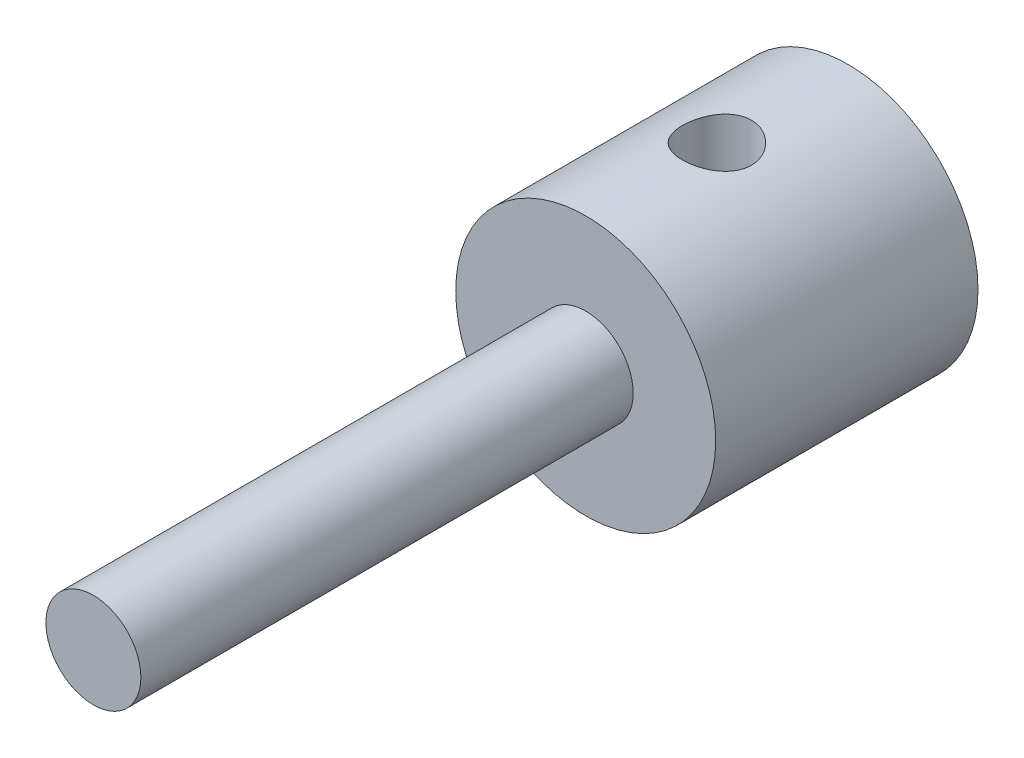
ISO-10303-21;
HEADER;
FILE_DESCRIPTION(('STEP AP214'),'2;1');
FILE_NAME('part.step','',(''),(''),'','','');
FILE_SCHEMA(('AUTOMOTIVE_DESIGN { 1 0 10303 214 1 1 1 1 }'));
ENDSEC;
DATA;
#1=APPLICATION_CONTEXT('core data for automotive mechanical design processes');
#2=APPLICATION_PROTOCOL_DEFINITION('international standard','automotive_design',2000,#1);
#3=PRODUCT_CONTEXT('',#1,'mechanical');
#4=PRODUCT('Part','Part','',(#3));
#5=PRODUCT_RELATED_PRODUCT_CATEGORY('part','',(#4));
#6=PRODUCT_DEFINITION_FORMATION('','',#4);
#7=PRODUCT_DEFINITION_CONTEXT('part definition',#1,'design');
#8=PRODUCT_DEFINITION('design','',#6,#7);
#9=PRODUCT_DEFINITION_SHAPE('','',#8);
#10=(LENGTH_UNIT() NAMED_UNIT(*) SI_UNIT(.MILLI.,.METRE.));
#11=(NAMED_UNIT(*) PLANE_ANGLE_UNIT() SI_UNIT($,.RADIAN.));
#12=(NAMED_UNIT(*) SI_UNIT($,.STERADIAN.) SOLID_ANGLE_UNIT());
#13=UNCERTAINTY_MEASURE_WITH_UNIT(LENGTH_MEASURE(1.E-05),#10,'distance_accuracy_value','');
#14=(GEOMETRIC_REPRESENTATION_CONTEXT(3) GLOBAL_UNCERTAINTY_ASSIGNED_CONTEXT((#13)) GLOBAL_UNIT_ASSIGNED_CONTEXT((#10,
#11,#12)) REPRESENTATION_CONTEXT('',''));
#15=CARTESIAN_POINT('',(0.,0.,0.));
#16=DIRECTION('',(0.,0.,1.));
#17=DIRECTION('',(1.,0.,0.));
#18=AXIS2_PLACEMENT_3D('',#15,#16,#17);
#19=CARTESIAN_POINT('',(0.,0.,-16.9164));
#20=DIRECTION('',(0.,0.,1.));
#21=DIRECTION('',(1.,0.,0.));
#22=AXIS2_PLACEMENT_3D('',#19,#20,#21);
#23=CYLINDRICAL_SURFACE('',#22,8.382);
#24=CARTESIAN_POINT('',(0.,0.,-16.9164));
#25=DIRECTION('',(0.,0.,-1.));
#26=DIRECTION('',(-1.,0.,0.));
#27=AXIS2_PLACEMENT_3D('',#24,#25,#26);
#28=CIRCLE('',#27,8.382);
#29=CARTESIAN_POINT('',(-8.382,0.,-16.9164));
#30=VERTEX_POINT('',#29);
#31=EDGE_CURVE('E50',#30,#30,#28,.T.);
#32=ORIENTED_EDGE('',*,*,#31,.F.);
#33=EDGE_LOOP('',(#32));
#34=FACE_BOUND('',#33,.T.);
#35=CARTESIAN_POINT('',(0.,0.,0.));
#36=DIRECTION('',(0.,0.,-1.));
#37=DIRECTION('',(-1.,0.,0.));
#38=AXIS2_PLACEMENT_3D('',#35,#36,#37);
#39=CIRCLE('',#38,8.382);
#40=CARTESIAN_POINT('',(-8.382,0.,0.));
#41=VERTEX_POINT('',#40);
#42=EDGE_CURVE('E52',#41,#41,#39,.T.);
#43=ORIENTED_EDGE('',*,*,#42,.T.);
#44=EDGE_LOOP('',(#43));
#45=FACE_BOUND('',#44,.T.);
#46=CARTESIAN_POINT('',(0.,8.382,-10.6807));
#47=CARTESIAN_POINT('',(-0.122545978010974,8.38199812819265,-10.6806970386751));
#48=CARTESIAN_POINT('',(-0.245123812219142,8.37928606400811,-10.670530452493));
#49=CARTESIAN_POINT('',(-0.486750048253878,8.36873043580727,-10.6302036663211));
#50=CARTESIAN_POINT('',(-0.605796693728954,8.36088436152248,-10.600033685598));
#51=CARTESIAN_POINT('',(-0.836837709561361,8.340926976709,-10.5207486710754));
#52=CARTESIAN_POINT('',(-0.948840901826804,8.32882113221359,-10.4716579083018));
#53=CARTESIAN_POINT('',(-1.16302416092692,8.30162450100949,-10.3560143856605));
#54=CARTESIAN_POINT('',(-1.26520360216536,8.28653352438844,-10.2894605147121));
#55=CARTESIAN_POINT('',(-1.45918344615048,8.25460959558927,-10.1391676179766));
#56=CARTESIAN_POINT('',(-1.55072631789723,8.23774713494352,-10.0551024625791));
#57=CARTESIAN_POINT('',(-1.71859362699717,8.20437082792396,-9.87287056469384));
#58=CARTESIAN_POINT('',(-1.79491612859954,8.18785702613164,-9.77470203124415));
#59=CARTESIAN_POINT('',(-1.93142771187019,8.1567463498054,-9.56499961077496));
#60=CARTESIAN_POINT('',(-1.99132128812834,8.1421867270313,-9.4532673227285));
#61=CARTESIAN_POINT('',(-2.09137178766778,8.11706643134214,-9.22087049946759));
#62=CARTESIAN_POINT('',(-2.13153230442965,8.10650503041303,-9.10020759516771));
#63=CARTESIAN_POINT('',(-2.19008375489065,8.09088150859754,-8.85622495756124));
#64=CARTESIAN_POINT('',(-2.20894124866035,8.08570173659757,-8.73302490682429));
#65=CARTESIAN_POINT('',(-2.22580580408932,8.08107637704488,-8.485109380742));
#66=CARTESIAN_POINT('',(-2.2238167139541,8.08162973117719,-8.36039418933174));
#67=CARTESIAN_POINT('',(-2.19941513873925,8.08830275877684,-8.11662404790133));
#68=CARTESIAN_POINT('',(-2.17756640119818,8.09426877646218,-7.99750779224802));
#69=CARTESIAN_POINT('',(-2.11496831355642,8.11084898776264,-7.76469520412358));
#70=CARTESIAN_POINT('',(-2.07421746813168,8.12146354911501,-7.6509993012352));
#71=CARTESIAN_POINT('',(-1.97451059869689,8.14628051850551,-7.43078141847667));
#72=CARTESIAN_POINT('',(-1.91535629063855,8.16052168164815,-7.32435376638653));
#73=CARTESIAN_POINT('',(-1.78066003182863,8.19096630395646,-7.12273694833066));
#74=CARTESIAN_POINT('',(-1.70511488828672,8.20717014516251,-7.02754997753708));
#75=CARTESIAN_POINT('',(-1.53689541110288,8.2403546405082,-6.84789470298942));
#76=CARTESIAN_POINT('',(-1.44374745386335,8.25734349869242,-6.76387077258234));
#77=CARTESIAN_POINT('',(-1.24447573385291,8.28971521559526,-6.61254602222629));
#78=CARTESIAN_POINT('',(-1.13835147133515,8.30509801241851,-6.54524584664979));
#79=CARTESIAN_POINT('',(-0.915456516708525,8.33261724039363,-6.42908642260741));
#80=CARTESIAN_POINT('',(-0.798642465139369,8.34473958658721,-6.38030682028556));
#81=CARTESIAN_POINT('',(-0.558077200635521,8.36427019139612,-6.30320566029928));
#82=CARTESIAN_POINT('',(-0.434327492072818,8.37167946802241,-6.27487968452517));
#83=CARTESIAN_POINT('',(-0.187196728785683,8.38079546465543,-6.24018579052901));
#84=CARTESIAN_POINT('',(-0.0639061623063624,8.38265906728263,-6.23321361931867));
#85=CARTESIAN_POINT('',(0.182082370726127,8.38092439164999,-6.23975759376545));
#86=CARTESIAN_POINT('',(0.304780396500954,8.3773266710522,-6.25327164755014));
#87=CARTESIAN_POINT('',(0.543949548413527,8.36517485010715,-6.29990859604152));
#88=CARTESIAN_POINT('',(0.660490978349239,8.3567058168777,-6.33269514799398));
#89=CARTESIAN_POINT('',(0.886408813652359,8.33577144200168,-6.41655642238661));
#90=CARTESIAN_POINT('',(0.995784445627639,8.32330566984695,-6.46763311501602));
#91=CARTESIAN_POINT('',(1.20661906617733,8.29539221507168,-6.58775027516686));
#92=CARTESIAN_POINT('',(1.30788303722989,8.27989131954893,-6.65712037148793));
#93=CARTESIAN_POINT('',(1.49754524093512,8.24769979907366,-6.81144013424169));
#94=CARTESIAN_POINT('',(1.58594095610842,8.23100894227215,-6.8963928418492));
#95=CARTESIAN_POINT('',(1.74989844085297,8.19774260926374,-7.08228492711395));
#96=CARTESIAN_POINT('',(1.82503409966079,8.18118329948936,-7.18360372067792));
#97=CARTESIAN_POINT('',(1.95724501291735,8.15056678188702,-7.39776100874965));
#98=CARTESIAN_POINT('',(2.01432102734526,8.13650946878185,-7.5105990182457));
#99=CARTESIAN_POINT('',(2.10836282435713,8.11264970195112,-7.74402378231656));
#100=CARTESIAN_POINT('',(2.14544544614609,8.10282259693757,-7.86456080933321));
#101=CARTESIAN_POINT('',(2.19872740220765,8.08852874432499,-8.11046399025629));
#102=CARTESIAN_POINT('',(2.21493199965927,8.08406064578392,-8.23582891887784));
#103=CARTESIAN_POINT('',(2.22569771544055,8.08110263926647,-8.48346924969944));
#104=CARTESIAN_POINT('',(2.22094333883804,8.0824236545137,-8.60571308410831));
#105=CARTESIAN_POINT('',(2.19151189817098,8.09045286267922,-8.84758893810199));
#106=CARTESIAN_POINT('',(2.16683533580764,8.0971609199354,-8.96722102338066));
#107=CARTESIAN_POINT('',(2.09865475813775,8.11509649678917,-9.19962690587846));
#108=CARTESIAN_POINT('',(2.05529423391998,8.12628952718532,-9.31244564731772));
#109=CARTESIAN_POINT('',(1.95108818138528,8.151935067394,-9.52929197088521));
#110=CARTESIAN_POINT('',(1.89023993891797,8.1663880830918,-9.63331818513908));
#111=CARTESIAN_POINT('',(1.75070449649565,8.19745080029808,-9.83289765218511));
#112=CARTESIAN_POINT('',(1.67154945137657,8.21411104617803,-9.92811598875334));
#113=CARTESIAN_POINT('',(1.49853913814835,8.24742698426666,-10.1041407692012));
#114=CARTESIAN_POINT('',(1.40468030927723,8.26408267439081,-10.1849437119931));
#115=CARTESIAN_POINT('',(1.20253956910181,8.29593255767638,-10.3315168733423));
#116=CARTESIAN_POINT('',(1.09399535791813,8.31108854765888,-10.3969343505541));
#117=CARTESIAN_POINT('',(0.867052612027074,8.3378149273992,-10.5084900770143));
#118=CARTESIAN_POINT('',(0.748660530095853,8.34938764196668,-10.5546408332058));
#119=CARTESIAN_POINT('',(0.525571813961633,8.36612687817697,-10.6202555406276));
#120=CARTESIAN_POINT('',(0.421846541743947,8.37203615634299,-10.6428699116922));
#121=CARTESIAN_POINT('',(0.212088650749228,8.37997334020725,-10.6730926997705));
#122=CARTESIAN_POINT('',(0.106056255318162,8.38200161993793,-10.6807025628506));
#123=CARTESIAN_POINT('',(0.,8.382,-10.6807));
#124=B_SPLINE_CURVE_WITH_KNOTS('',3,(#46,#47,#48,#49,#50,#51,#52,#53,#54,#55,#56,#57,#58,#59,
#60,#61,#62,#63,#64,#65,#66,#67,#68,#69,#70,#71,#72,#73,#74,#75,#76,#77,#78,#79,#80,#81,#82,#83,
#84,#85,#86,#87,#88,#89,#90,#91,#92,#93,#94,#95,#96,#97,#98,#99,#100,#101,#102,#103,#104,#105,
#106,#107,#108,#109,#110,#111,#112,#113,#114,#115,#116,#117,#118,#119,#120,#121,#122,#123),
.UNSPECIFIED.,.T.,.F.,(4,2,2,2,2,2,2,2,2,2,2,2,2,2,2,2,2,2,2,2,2,2,2,2,2,2,2,2,2,2,2,2,2,2,2,2,
2,2,4),(0.,0.367249024550624,0.734677749414668,1.10163670774985,1.46861901931274,
1.84317026950239,2.21776912537664,2.59871975887543,2.97960099378303,3.35196817977556,
3.72426662931593,4.08631599369094,4.44839400426113,4.81451677461364,5.18071092658654,
5.55870823441772,5.93672010436764,6.31633964995009,6.69587717081559,7.06457070353036,
7.43322659105252,7.79563210274222,8.15807666401272,8.52756069639389,8.89711691586868,
9.27696784974287,9.65680279674585,10.034393284835,10.4118885668166,10.777148102092,
11.1423984393086,11.5048923312803,11.8674425138857,12.2405494597047,12.6137468995502,
12.9948102364691,13.3756258209951,13.6934886445958,14.0113208325245),.UNSPECIFIED.);
#125=CARTESIAN_POINT('',(0.,8.382,-10.6807));
#126=VERTEX_POINT('',#125);
#127=EDGE_CURVE('E61',#126,#126,#124,.T.);
#128=ORIENTED_EDGE('',*,*,#127,.F.);
#129=EDGE_LOOP('',(#128));
#130=FACE_BOUND('',#129,.T.);
#131=ADVANCED_FACE('F33',(#34,#45,#130),#23,.T.);
#132=CARTESIAN_POINT('',(0.,0.,-2.9464));
#133=DIRECTION('',(0.,0.,-1.));
#134=DIRECTION('',(-1.,0.,0.));
#135=AXIS2_PLACEMENT_3D('',#132,#133,#134);
#136=CYLINDRICAL_SURFACE('',#135,2.9972);
#137=CARTESIAN_POINT('',(0.,0.,-2.9464));
#138=DIRECTION('',(0.,0.,-1.));
#139=DIRECTION('',(-1.,0.,0.));
#140=AXIS2_PLACEMENT_3D('',#137,#138,#139);
#141=CIRCLE('',#140,2.9972);
#142=CARTESIAN_POINT('',(-2.9972,0.,-2.9464));
#143=VERTEX_POINT('',#142);
#144=EDGE_CURVE('E55',#143,#143,#141,.T.);
#145=ORIENTED_EDGE('',*,*,#144,.F.);
#146=EDGE_LOOP('',(#145));
#147=FACE_BOUND('',#146,.T.);
#148=CARTESIAN_POINT('',(0.,0.,-16.9164));
#149=DIRECTION('',(0.,0.,-1.));
#150=DIRECTION('',(-1.,0.,0.));
#151=AXIS2_PLACEMENT_3D('',#148,#149,#150);
#152=CIRCLE('',#151,2.9972);
#153=CARTESIAN_POINT('',(-2.9972,0.,-16.9164));
#154=VERTEX_POINT('',#153);
#155=EDGE_CURVE('E58',#154,#154,#152,.T.);
#156=ORIENTED_EDGE('',*,*,#155,.T.);
#157=EDGE_LOOP('',(#156));
#158=FACE_BOUND('',#157,.T.);
#159=CARTESIAN_POINT('',(0.,2.9972,-10.6807));
#160=CARTESIAN_POINT('',(0.109035099131948,2.99720532292805,-10.6807056711309));
#161=CARTESIAN_POINT('',(0.218041881013003,2.99120315374028,-10.6726320712692));
#162=CARTESIAN_POINT('',(0.432500741748234,2.96779220280792,-10.6409055543326));
#163=CARTESIAN_POINT('',(0.537951674348827,2.95037977915565,-10.6172476630745));
#164=CARTESIAN_POINT('',(0.741829756690686,2.90581275024957,-10.5559333523464));
#165=CARTESIAN_POINT('',(0.840289918130865,2.87870817161617,-10.5183487807931));
#166=CARTESIAN_POINT('',(1.02892321132619,2.8168052943043,-10.4309245473292));
#167=CARTESIAN_POINT('',(1.11909516007605,2.78200589972481,-10.381083139678));
#168=CARTESIAN_POINT('',(1.29798354732295,2.70348726825274,-10.2657115164916));
#169=CARTESIAN_POINT('',(1.38580620765091,2.65924241592886,-10.199160998928));
#170=CARTESIAN_POINT('',(1.54979276999448,2.5671416162179,-10.0549453529002));
#171=CARTESIAN_POINT('',(1.6259390189458,2.5192803612725,-9.97726373217307));
#172=CARTESIAN_POINT('',(1.7799945363051,2.41354080730972,-9.79537788800906));
#173=CARTESIAN_POINT('',(1.85524675559172,2.3555620740222,-9.68897077445555));
#174=CARTESIAN_POINT('',(1.98703950270951,2.2454886485102,-9.46234788504766));
#175=CARTESIAN_POINT('',(2.04360659485169,2.19338567288698,-9.34215204301542));
#176=CARTESIAN_POINT('',(2.11989820223383,2.11921234350903,-9.13160209110231));
#177=CARTESIAN_POINT('',(2.14561239568252,2.09294584069497,-9.04491706776201));
#178=CARTESIAN_POINT('',(2.18650804934123,2.05018869414046,-8.86685099578248));
#179=CARTESIAN_POINT('',(2.20171363699889,2.03367566946942,-8.77548122524885));
#180=CARTESIAN_POINT('',(2.22061231337168,2.01303471459662,-8.58931415274329));
#181=CARTESIAN_POINT('',(2.22420898801771,2.00901051684749,-8.49449472714926));
#182=CARTESIAN_POINT('',(2.21926766391049,2.01446392631861,-8.30554265570776));
#183=CARTESIAN_POINT('',(2.21072242090711,2.02394959395759,-8.21141045356794));
#184=CARTESIAN_POINT('',(2.1808507794525,2.05611369443962,-8.01782262165642));
#185=CARTESIAN_POINT('',(2.15834387962291,2.08000413894299,-7.91876126520141));
#186=CARTESIAN_POINT('',(2.10122905421232,2.13768121211554,-7.72718069518969));
#187=CARTESIAN_POINT('',(2.06659181854494,2.1714917780213,-7.63467798594968));
#188=CARTESIAN_POINT('',(1.9718833393778,2.25839887917944,-7.42429489525977));
#189=CARTESIAN_POINT('',(1.9071430696203,2.31401781966607,-7.30957255385851));
#190=CARTESIAN_POINT('',(1.75949772511076,2.42819439988397,-7.09410575190113));
#191=CARTESIAN_POINT('',(1.6765707092981,2.48675552279652,-6.99337841722047));
#192=CARTESIAN_POINT('',(1.49187945649707,2.6018354844121,-6.80549809752687));
#193=CARTESIAN_POINT('',(1.38983000454973,2.65830542550551,-6.71859334684983));
#194=CARTESIAN_POINT('',(1.16885883192932,2.76257486261184,-6.56309389913785));
#195=CARTESIAN_POINT('',(1.04997641167578,2.81039397978635,-6.49445759584357));
#196=CARTESIAN_POINT('',(0.829827544269857,2.88173185064131,-6.39384026692525));
#197=CARTESIAN_POINT('',(0.731790262563047,2.90833777525947,-6.35697557327025));
#198=CARTESIAN_POINT('',(0.529502656039147,2.95186457441896,-6.29712865900452));
#199=CARTESIAN_POINT('',(0.425257000813782,2.96879262901982,-6.27413614585211));
#200=CARTESIAN_POINT('',(0.212868052630599,2.9915452743464,-6.2433069810004));
#201=CARTESIAN_POINT('',(0.104710160651017,2.99732267926841,-6.23553473433707));
#202=CARTESIAN_POINT('',(-0.111569893247598,2.99707339577507,-6.23587055875599));
#203=CARTESIAN_POINT('',(-0.219692056475167,2.9910472025299,-6.24397796367443));
#204=CARTESIAN_POINT('',(-0.4252738518247,2.96855833877157,-6.27445740338059));
#205=CARTESIAN_POINT('',(-0.522963922494001,2.9528177785735,-6.29584302780928));
#206=CARTESIAN_POINT('',(-0.712966434107031,2.91278598553164,-6.35083787638103));
#207=CARTESIAN_POINT('',(-0.805277734854912,2.88849294735714,-6.38444968138138));
#208=CARTESIAN_POINT('',(-0.989486731079138,2.83092133920847,-6.46539184091329));
#209=CARTESIAN_POINT('',(-1.08084970441508,2.79711139810299,-6.5135524508863));
#210=CARTESIAN_POINT('',(-1.25440765668035,2.72370416069296,-6.62070555372603));
#211=CARTESIAN_POINT('',(-1.33659753993963,2.68410367566681,-6.67970401937207));
#212=CARTESIAN_POINT('',(-1.50539842062506,2.59378845733997,-6.81888618404942));
#213=CARTESIAN_POINT('',(-1.59006182935852,2.54236655058438,-6.90097091289021));
#214=CARTESIAN_POINT('',(-1.74525552217857,2.43844558445444,-7.07711610123342));
#215=CARTESIAN_POINT('',(-1.81577047612092,2.38594542391928,-7.17118937209334));
#216=CARTESIAN_POINT('',(-1.93729118686856,2.28817420186694,-7.36348348178134));
#217=CARTESIAN_POINT('',(-1.98933557720171,2.24265478924763,-7.46091892553725));
#218=CARTESIAN_POINT('',(-2.07922363265181,2.15957842965884,-7.66527126891202));
#219=CARTESIAN_POINT('',(-2.11709637153837,2.12200525031176,-7.77216819418977));
#220=CARTESIAN_POINT('',(-2.16913313860419,2.06859988440495,-7.96648139197947));
#221=CARTESIAN_POINT('',(-2.18685914978445,2.04967962929019,-8.05207353449315));
#222=CARTESIAN_POINT('',(-2.21211845217175,2.02239936901333,-8.22634437365271));
#223=CARTESIAN_POINT('',(-2.21966932784353,2.0140211469864,-8.31501747301847));
#224=CARTESIAN_POINT('',(-2.22401562137212,2.00922324859766,-8.49326627516366));
#225=CARTESIAN_POINT('',(-2.22077525670104,2.01284335714816,-8.58284399693982));
#226=CARTESIAN_POINT('',(-2.20373903341435,2.0314742142425,-8.75981691272162));
#227=CARTESIAN_POINT('',(-2.18992879611382,2.0465004788774,-8.84720896608712));
#228=CARTESIAN_POINT('',(-2.14781658238966,2.09074963344026,-9.04002262174662));
#229=CARTESIAN_POINT('',(-2.11667082053348,2.1226561648085,-9.14418832226784));
#230=CARTESIAN_POINT('',(-2.04106025204124,2.19545727262221,-9.34424780564446));
#231=CARTESIAN_POINT('',(-1.99656230638566,2.23637414395533,-9.44012023357628));
#232=CARTESIAN_POINT('',(-1.88025664333206,2.33566072222533,-9.65097752365637));
#233=CARTESIAN_POINT('',(-1.80425922226611,2.39555857109272,-9.76293278598721));
#234=CARTESIAN_POINT('',(-1.63332858952915,2.51522766353803,-9.97144787941594));
#235=CARTESIAN_POINT('',(-1.53838353395515,2.57499880417573,-10.0679980127088));
#236=CARTESIAN_POINT('',(-1.3298804535192,2.68863998761749,-10.2441473935047));
#237=CARTESIAN_POINT('',(-1.21624796482793,2.74248492192893,-10.323675771344));
#238=CARTESIAN_POINT('',(-0.972328163705266,2.83810342797671,-10.4615948639828));
#239=CARTESIAN_POINT('',(-0.842079734628006,2.87990446258616,-10.5200337458536));
#240=CARTESIAN_POINT('',(-0.593804785154801,2.94003708158251,-10.6031407355289));
#241=CARTESIAN_POINT('',(-0.477901732315621,2.9612632825119,-10.632031201801));
#242=CARTESIAN_POINT('',(-0.24131708922385,2.98983374144282,-10.6707966620775));
#243=CARTESIAN_POINT('',(-0.1206412113689,2.99719411047916,-10.6806937252123));
#244=CARTESIAN_POINT('',(0.,2.9972,-10.6807));
#245=B_SPLINE_CURVE_WITH_KNOTS('',3,(#159,#160,#161,#162,#163,#164,#165,#166,#167,#168,#169,
#170,#171,#172,#173,#174,#175,#176,#177,#178,#179,#180,#181,#182,#183,#184,#185,#186,#187,#188,
#189,#190,#191,#192,#193,#194,#195,#196,#197,#198,#199,#200,#201,#202,#203,#204,#205,#206,#207,
#208,#209,#210,#211,#212,#213,#214,#215,#216,#217,#218,#219,#220,#221,#222,#223,#224,#225,#226,
#227,#228,#229,#230,#231,#232,#233,#234,#235,#236,#237,#238,#239,#240,#241,#242,#243,#244),
.UNSPECIFIED.,.T.,.F.,(4,2,2,2,2,2,2,2,2,2,2,2,2,2,2,2,2,2,2,2,2,2,2,2,2,2,2,2,2,2,2,2,2,2,2,2,
2,2,2,2,2,2,4),(0.,0.326613191240692,0.653330681193292,0.978385581177505,1.30348680555821,
1.65843704523608,2.01391873747389,2.44004684667779,2.86556650325745,3.14706259735965,
3.42791021820336,3.7110844057956,3.99442761497757,4.30579418085348,4.61791834105378,
5.04468412338796,5.47196762970639,5.90622118426497,6.3394770985406,6.66234437453225,
6.98497180180879,7.3089615121698,7.63293763119982,7.93532796489784,8.23778216806264,
8.56258828144812,8.88757393655642,9.27208507532543,9.65701061637565,10.0142412259045,
10.370734889814,10.6379664019717,10.9047354951692,11.1723900439871,11.4404093441979,
11.7784630123687,12.1173627410113,12.5591115872137,13.0011374343057,13.444969309353,
13.8877809874916,14.2495807773424,14.610959923636),.UNSPECIFIED.);
#246=CARTESIAN_POINT('',(0.,2.9972,-10.6807));
#247=VERTEX_POINT('',#246);
#248=EDGE_CURVE('E37',#247,#247,#245,.T.);
#249=ORIENTED_EDGE('',*,*,#248,.F.);
#250=EDGE_LOOP('',(#249));
#251=FACE_BOUND('',#250,.T.);
#252=ADVANCED_FACE('F80',(#147,#158,#251),#136,.F.);
#253=CARTESIAN_POINT('',(0.,0.,31.75));
#254=DIRECTION('',(0.,0.,-1.));
#255=DIRECTION('',(-1.,0.,0.));
#256=AXIS2_PLACEMENT_3D('',#253,#254,#255);
#257=CYLINDRICAL_SURFACE('',#256,3.06197);
#258=CARTESIAN_POINT('',(0.,0.,31.75));
#259=DIRECTION('',(0.,0.,1.));
#260=DIRECTION('',(1.,0.,0.));
#261=AXIS2_PLACEMENT_3D('',#258,#259,#260);
#262=CIRCLE('',#261,3.06197);
#263=CARTESIAN_POINT('',(3.06197,0.,31.75));
#264=VERTEX_POINT('',#263);
#265=EDGE_CURVE('E10',#264,#264,#262,.T.);
#266=ORIENTED_EDGE('',*,*,#265,.F.);
#267=EDGE_LOOP('',(#266));
#268=FACE_BOUND('',#267,.T.);
#269=CARTESIAN_POINT('',(0.,0.,0.));
#270=DIRECTION('',(0.,0.,1.));
#271=DIRECTION('',(1.,0.,0.));
#272=AXIS2_PLACEMENT_3D('',#269,#270,#271);
#273=CIRCLE('',#272,3.06197);
#274=CARTESIAN_POINT('',(3.06197,0.,0.));
#275=VERTEX_POINT('',#274);
#276=EDGE_CURVE('E45',#275,#275,#273,.T.);
#277=ORIENTED_EDGE('',*,*,#276,.T.);
#278=EDGE_LOOP('',(#277));
#279=FACE_BOUND('',#278,.T.);
#280=ADVANCED_FACE('F35',(#268,#279),#257,.T.);
#281=CARTESIAN_POINT('',(0.,0.,31.75));
#282=DIRECTION('',(0.,0.,1.));
#283=DIRECTION('',(1.,0.,0.));
#284=AXIS2_PLACEMENT_3D('',#281,#282,#283);
#285=PLANE('',#284);
#286=ORIENTED_EDGE('',*,*,#265,.T.);
#287=EDGE_LOOP('',(#286));
#288=FACE_BOUND('',#287,.T.);
#289=ADVANCED_FACE('F87',(#288),#285,.T.);
#290=CARTESIAN_POINT('',(0.,0.,-16.9164));
#291=DIRECTION('',(0.,0.,-1.));
#292=DIRECTION('',(-1.,0.,0.));
#293=AXIS2_PLACEMENT_3D('',#290,#291,#292);
#294=PLANE('',#293);
#295=ORIENTED_EDGE('',*,*,#155,.F.);
#296=EDGE_LOOP('',(#295));
#297=FACE_BOUND('',#296,.T.);
#298=ORIENTED_EDGE('',*,*,#31,.T.);
#299=EDGE_LOOP('',(#298));
#300=FACE_BOUND('',#299,.T.);
#301=ADVANCED_FACE('F85',(#297,#300),#294,.T.);
#302=CARTESIAN_POINT('',(0.,0.,0.));
#303=DIRECTION('',(0.,0.,-1.));
#304=DIRECTION('',(-1.,0.,0.));
#305=AXIS2_PLACEMENT_3D('',#302,#303,#304);
#306=PLANE('',#305);
#307=ORIENTED_EDGE('',*,*,#276,.F.);
#308=EDGE_LOOP('',(#307));
#309=FACE_BOUND('',#308,.T.);
#310=ORIENTED_EDGE('',*,*,#42,.F.);
#311=EDGE_LOOP('',(#310));
#312=FACE_BOUND('',#311,.T.);
#313=ADVANCED_FACE('F78',(#309,#312),#306,.F.);
#314=CARTESIAN_POINT('',(0.,0.,-2.9464));
#315=DIRECTION('',(0.,0.,-1.));
#316=DIRECTION('',(-1.,0.,0.));
#317=AXIS2_PLACEMENT_3D('',#314,#315,#316);
#318=PLANE('',#317);
#319=ORIENTED_EDGE('',*,*,#144,.T.);
#320=EDGE_LOOP('',(#319));
#321=FACE_BOUND('',#320,.T.);
#322=ADVANCED_FACE('F74',(#321),#318,.T.);
#323=CARTESIAN_POINT('',(0.,13.97,-8.4582));
#324=DIRECTION('',(0.,-1.,0.));
#325=DIRECTION('',(0.,0.,-1.));
#326=AXIS2_PLACEMENT_3D('',#323,#324,#325);
#327=CYLINDRICAL_SURFACE('',#326,2.2225);
#328=ORIENTED_EDGE('',*,*,#248,.T.);
#329=EDGE_LOOP('',(#328));
#330=FACE_BOUND('',#329,.T.);
#331=ORIENTED_EDGE('',*,*,#127,.T.);
#332=EDGE_LOOP('',(#331));
#333=FACE_BOUND('',#332,.T.);
#334=ADVANCED_FACE('F70',(#330,#333),#327,.F.);
#335=CLOSED_SHELL('',(#131,#252,#280,#289,#301,#313,#322,#334));
#336=MANIFOLD_SOLID_BREP('B2',#335);
#337=ADVANCED_BREP_SHAPE_REPRESENTATION('',(#18,#336),#14);
#338=SHAPE_DEFINITION_REPRESENTATION(#9,#337);
ENDSEC;
END-ISO-10303-21;
